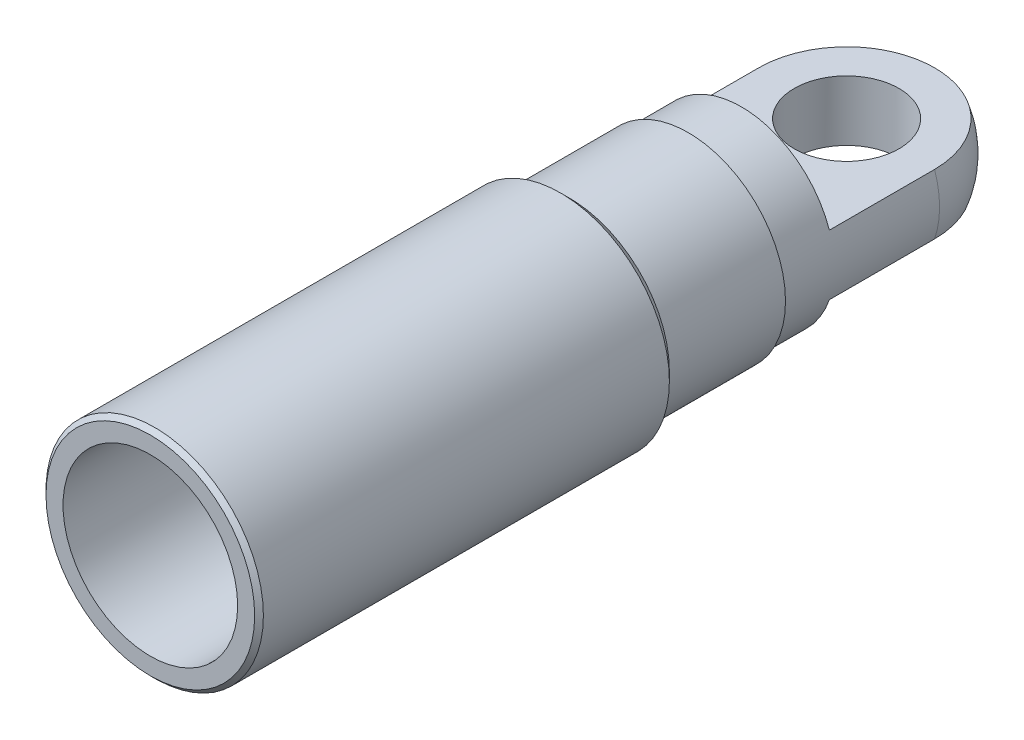
ISO-10303-21;
HEADER;
FILE_DESCRIPTION(('STEP AP214'),'2;1');
FILE_NAME('part.step','',(''),(''),'','','');
FILE_SCHEMA(('AUTOMOTIVE_DESIGN { 1 0 10303 214 1 1 1 1 }'));
ENDSEC;
DATA;
#1=APPLICATION_CONTEXT('core data for automotive mechanical design processes');
#2=APPLICATION_PROTOCOL_DEFINITION('international standard','automotive_design',2000,#1);
#3=PRODUCT_CONTEXT('',#1,'mechanical');
#4=PRODUCT('Part','Part','',(#3));
#5=PRODUCT_RELATED_PRODUCT_CATEGORY('part','',(#4));
#6=PRODUCT_DEFINITION_FORMATION('','',#4);
#7=PRODUCT_DEFINITION_CONTEXT('part definition',#1,'design');
#8=PRODUCT_DEFINITION('design','',#6,#7);
#9=PRODUCT_DEFINITION_SHAPE('','',#8);
#10=(LENGTH_UNIT() NAMED_UNIT(*) SI_UNIT(.MILLI.,.METRE.));
#11=(NAMED_UNIT(*) PLANE_ANGLE_UNIT() SI_UNIT($,.RADIAN.));
#12=(NAMED_UNIT(*) SI_UNIT($,.STERADIAN.) SOLID_ANGLE_UNIT());
#13=UNCERTAINTY_MEASURE_WITH_UNIT(LENGTH_MEASURE(1.E-05),#10,'distance_accuracy_value','');
#14=(GEOMETRIC_REPRESENTATION_CONTEXT(3) GLOBAL_UNCERTAINTY_ASSIGNED_CONTEXT((#13)) GLOBAL_UNIT_ASSIGNED_CONTEXT((#10,
#11,#12)) REPRESENTATION_CONTEXT('',''));
#15=CARTESIAN_POINT('',(0.,0.,0.));
#16=DIRECTION('',(0.,0.,1.));
#17=DIRECTION('',(1.,0.,0.));
#18=AXIS2_PLACEMENT_3D('',#15,#16,#17);
#19=CARTESIAN_POINT('',(0.,0.,14.4));
#20=DIRECTION('',(0.,0.,-1.));
#21=DIRECTION('',(-1.,0.,0.));
#22=AXIS2_PLACEMENT_3D('',#19,#20,#21);
#23=CYLINDRICAL_SURFACE('',#22,5.325);
#24=CARTESIAN_POINT('',(0.,0.,14.4));
#25=DIRECTION('',(0.,0.,1.));
#26=DIRECTION('',(1.,0.,0.));
#27=AXIS2_PLACEMENT_3D('',#24,#25,#26);
#28=CIRCLE('',#27,5.325);
#29=CARTESIAN_POINT('',(5.325,0.,14.4));
#30=VERTEX_POINT('',#29);
#31=EDGE_CURVE('E107',#30,#30,#28,.T.);
#32=ORIENTED_EDGE('',*,*,#31,.F.);
#33=EDGE_LOOP('',(#32));
#34=FACE_BOUND('',#33,.T.);
#35=DIRECTION('',(0.,0.,-1.));
#36=VECTOR('',#35,1.);
#37=CARTESIAN_POINT('',(-5.037856687124,-1.725,14.4));
#38=LINE('',#37,#36);
#39=CARTESIAN_POINT('',(-5.037856687124,-1.725,11.35));
#40=VERTEX_POINT('',#39);
#41=CARTESIAN_POINT('',(-5.037856687124,-1.725,5.325));
#42=VERTEX_POINT('',#41);
#43=EDGE_CURVE('E59',#40,#42,#38,.T.);
#44=ORIENTED_EDGE('',*,*,#43,.F.);
#45=CARTESIAN_POINT('',(0.,0.,11.35));
#46=DIRECTION('',(0.,0.,-1.));
#47=DIRECTION('',(-1.,0.,0.));
#48=AXIS2_PLACEMENT_3D('',#45,#46,#47);
#49=CIRCLE('',#48,5.325);
#50=CARTESIAN_POINT('',(5.037856687124,-1.725,11.35));
#51=VERTEX_POINT('',#50);
#52=EDGE_CURVE('E84',#51,#40,#49,.T.);
#53=ORIENTED_EDGE('',*,*,#52,.F.);
#54=DIRECTION('',(0.,0.,-1.));
#55=VECTOR('',#54,1.);
#56=CARTESIAN_POINT('',(5.037856687124,-1.725,14.4));
#57=LINE('',#56,#55);
#58=CARTESIAN_POINT('',(5.037856687124,-1.725,5.325));
#59=VERTEX_POINT('',#58);
#60=EDGE_CURVE('E96',#59,#51,#57,.F.);
#61=ORIENTED_EDGE('',*,*,#60,.F.);
#62=CARTESIAN_POINT('',(0.,0.,5.325));
#63=DIRECTION('',(0.,0.,-1.));
#64=DIRECTION('',(-1.,0.,0.));
#65=AXIS2_PLACEMENT_3D('',#62,#63,#64);
#66=CIRCLE('',#65,5.325);
#67=CARTESIAN_POINT('',(5.037856687124,1.725,5.325));
#68=VERTEX_POINT('',#67);
#69=EDGE_CURVE('E95',#59,#68,#66,.F.);
#70=ORIENTED_EDGE('',*,*,#69,.T.);
#71=DIRECTION('',(0.,0.,-1.));
#72=VECTOR('',#71,1.);
#73=CARTESIAN_POINT('',(5.037856687124,1.725,14.4));
#74=LINE('',#73,#72);
#75=CARTESIAN_POINT('',(5.037856687124,1.725,11.35));
#76=VERTEX_POINT('',#75);
#77=EDGE_CURVE('E51',#76,#68,#74,.T.);
#78=ORIENTED_EDGE('',*,*,#77,.F.);
#79=CARTESIAN_POINT('',(0.,0.,11.35));
#80=DIRECTION('',(0.,0.,-1.));
#81=DIRECTION('',(-1.,0.,0.));
#82=AXIS2_PLACEMENT_3D('',#79,#80,#81);
#83=CIRCLE('',#82,5.325);
#84=CARTESIAN_POINT('',(-5.037856687124,1.725,11.35));
#85=VERTEX_POINT('',#84);
#86=EDGE_CURVE('E79',#85,#76,#83,.T.);
#87=ORIENTED_EDGE('',*,*,#86,.F.);
#88=DIRECTION('',(0.,0.,-1.));
#89=VECTOR('',#88,1.);
#90=CARTESIAN_POINT('',(-5.037856687124,1.725,14.4));
#91=LINE('',#90,#89);
#92=CARTESIAN_POINT('',(-5.037856687124,1.725,5.325));
#93=VERTEX_POINT('',#92);
#94=EDGE_CURVE('E88',#93,#85,#91,.F.);
#95=ORIENTED_EDGE('',*,*,#94,.F.);
#96=EDGE_CURVE('E112',#93,#42,#66,.F.);
#97=ORIENTED_EDGE('',*,*,#96,.T.);
#98=EDGE_LOOP('',(#44,#53,#61,#70,#78,#87,#95,#97));
#99=FACE_BOUND('',#98,.T.);
#100=ADVANCED_FACE('F36',(#34,#99),#23,.T.);
#101=CARTESIAN_POINT('',(0.,0.,5.325));
#102=DIRECTION('',(0.,0.,1.));
#103=DIRECTION('',(1.,0.,0.));
#104=AXIS2_PLACEMENT_3D('',#101,#102,#103);
#105=SPHERICAL_SURFACE('',#104,5.325);
#106=ORIENTED_EDGE('',*,*,#69,.F.);
#107=CARTESIAN_POINT('',(0.,-1.725,5.325));
#108=DIRECTION('',(0.,-1.,0.));
#109=DIRECTION('',(0.,0.,-1.));
#110=AXIS2_PLACEMENT_3D('',#107,#108,#109);
#111=CIRCLE('',#110,5.037856687124);
#112=EDGE_CURVE('E85',#59,#42,#111,.F.);
#113=ORIENTED_EDGE('',*,*,#112,.T.);
#114=ORIENTED_EDGE('',*,*,#96,.F.);
#115=CARTESIAN_POINT('',(0.,1.725,5.325));
#116=DIRECTION('',(0.,1.,0.));
#117=DIRECTION('',(0.,0.,1.));
#118=AXIS2_PLACEMENT_3D('',#115,#116,#117);
#119=CIRCLE('',#118,5.037856687124);
#120=EDGE_CURVE('E115',#93,#68,#119,.F.);
#121=ORIENTED_EDGE('',*,*,#120,.T.);
#122=EDGE_LOOP('',(#106,#113,#114,#121));
#123=FACE_BOUND('',#122,.T.);
#124=ADVANCED_FACE('F144',(#123),#105,.T.);
#125=CARTESIAN_POINT('',(0.,0.,14.4));
#126=DIRECTION('',(0.,0.,1.));
#127=DIRECTION('',(1.,0.,0.));
#128=AXIS2_PLACEMENT_3D('',#125,#126,#127);
#129=PLANE('',#128);
#130=CARTESIAN_POINT('',(0.,0.,14.4));
#131=DIRECTION('',(0.,0.,1.));
#132=DIRECTION('',(1.,0.,0.));
#133=AXIS2_PLACEMENT_3D('',#130,#131,#132);
#134=CIRCLE('',#133,5.575);
#135=CARTESIAN_POINT('',(5.575,0.,14.4));
#136=VERTEX_POINT('',#135);
#137=EDGE_CURVE('E103',#136,#136,#134,.T.);
#138=ORIENTED_EDGE('',*,*,#137,.F.);
#139=EDGE_LOOP('',(#138));
#140=FACE_BOUND('',#139,.T.);
#141=ORIENTED_EDGE('',*,*,#31,.T.);
#142=EDGE_LOOP('',(#141));
#143=FACE_BOUND('',#142,.T.);
#144=ADVANCED_FACE('F150',(#140,#143),#129,.F.);
#145=CARTESIAN_POINT('',(0.,0.,21.2));
#146=DIRECTION('',(0.,0.,-1.));
#147=DIRECTION('',(-1.,0.,0.));
#148=AXIS2_PLACEMENT_3D('',#145,#146,#147);
#149=CYLINDRICAL_SURFACE('',#148,5.575);
#150=CARTESIAN_POINT('',(0.,0.,21.2));
#151=DIRECTION('',(0.,0.,1.));
#152=DIRECTION('',(1.,0.,0.));
#153=AXIS2_PLACEMENT_3D('',#150,#151,#152);
#154=CIRCLE('',#153,5.575);
#155=CARTESIAN_POINT('',(5.575,0.,21.2));
#156=VERTEX_POINT('',#155);
#157=EDGE_CURVE('E104',#156,#156,#154,.T.);
#158=ORIENTED_EDGE('',*,*,#157,.F.);
#159=EDGE_LOOP('',(#158));
#160=FACE_BOUND('',#159,.T.);
#161=ORIENTED_EDGE('',*,*,#137,.T.);
#162=EDGE_LOOP('',(#161));
#163=FACE_BOUND('',#162,.T.);
#164=ADVANCED_FACE('F155',(#160,#163),#149,.T.);
#165=CARTESIAN_POINT('',(0.,0.,21.2));
#166=DIRECTION('',(0.,0.,1.));
#167=DIRECTION('',(1.,0.,0.));
#168=AXIS2_PLACEMENT_3D('',#165,#166,#167);
#169=PLANE('',#168);
#170=CARTESIAN_POINT('',(0.,0.,21.2));
#171=DIRECTION('',(0.,0.,1.));
#172=DIRECTION('',(1.,0.,0.));
#173=AXIS2_PLACEMENT_3D('',#170,#171,#172);
#174=CIRCLE('',#173,5.725);
#175=CARTESIAN_POINT('',(5.725,0.,21.2));
#176=VERTEX_POINT('',#175);
#177=EDGE_CURVE('E125',#176,#176,#174,.F.);
#178=ORIENTED_EDGE('',*,*,#177,.T.);
#179=EDGE_LOOP('',(#178));
#180=FACE_BOUND('',#179,.T.);
#181=ORIENTED_EDGE('',*,*,#157,.T.);
#182=EDGE_LOOP('',(#181));
#183=FACE_BOUND('',#182,.T.);
#184=ADVANCED_FACE('F176',(#180,#183),#169,.F.);
#185=CARTESIAN_POINT('',(0.,0.,45.2));
#186=DIRECTION('',(0.,0.,-1.));
#187=DIRECTION('',(-1.,0.,0.));
#188=AXIS2_PLACEMENT_3D('',#185,#186,#187);
#189=CYLINDRICAL_SURFACE('',#188,6.225);
#190=CARTESIAN_POINT('',(0.,0.,44.95));
#191=DIRECTION('',(0.,0.,1.));
#192=DIRECTION('',(1.,0.,0.));
#193=AXIS2_PLACEMENT_3D('',#190,#191,#192);
#194=CIRCLE('',#193,6.225);
#195=CARTESIAN_POINT('',(6.225,0.,44.95));
#196=VERTEX_POINT('',#195);
#197=EDGE_CURVE('E11',#196,#196,#194,.F.);
#198=ORIENTED_EDGE('',*,*,#197,.T.);
#199=EDGE_LOOP('',(#198));
#200=FACE_BOUND('',#199,.T.);
#201=CARTESIAN_POINT('',(0.,0.,21.7));
#202=DIRECTION('',(0.,0.,1.));
#203=DIRECTION('',(1.,0.,0.));
#204=AXIS2_PLACEMENT_3D('',#201,#202,#203);
#205=CIRCLE('',#204,6.225);
#206=CARTESIAN_POINT('',(6.225,0.,21.7));
#207=VERTEX_POINT('',#206);
#208=EDGE_CURVE('E119',#207,#207,#205,.T.);
#209=ORIENTED_EDGE('',*,*,#208,.T.);
#210=EDGE_LOOP('',(#209));
#211=FACE_BOUND('',#210,.T.);
#212=ADVANCED_FACE('F174',(#200,#211),#189,.T.);
#213=CARTESIAN_POINT('',(0.,0.,45.2));
#214=DIRECTION('',(0.,0.,1.));
#215=DIRECTION('',(1.,0.,0.));
#216=AXIS2_PLACEMENT_3D('',#213,#214,#215);
#217=PLANE('',#216);
#218=CARTESIAN_POINT('',(0.,0.,45.2));
#219=DIRECTION('',(0.,0.,1.));
#220=DIRECTION('',(1.,0.,0.));
#221=AXIS2_PLACEMENT_3D('',#218,#219,#220);
#222=CIRCLE('',#221,5.97500000000001);
#223=CARTESIAN_POINT('',(5.97500000000001,0.,45.2));
#224=VERTEX_POINT('',#223);
#225=EDGE_CURVE('E44',#224,#224,#222,.T.);
#226=ORIENTED_EDGE('',*,*,#225,.T.);
#227=EDGE_LOOP('',(#226));
#228=FACE_BOUND('',#227,.T.);
#229=CARTESIAN_POINT('',(0.,0.,45.2));
#230=DIRECTION('',(0.,0.,1.));
#231=DIRECTION('',(1.,0.,0.));
#232=AXIS2_PLACEMENT_3D('',#229,#230,#231);
#233=CIRCLE('',#232,5.);
#234=CARTESIAN_POINT('',(5.,0.,45.2));
#235=VERTEX_POINT('',#234);
#236=EDGE_CURVE('E299',#235,#235,#233,.T.);
#237=ORIENTED_EDGE('',*,*,#236,.F.);
#238=EDGE_LOOP('',(#237));
#239=FACE_BOUND('',#238,.T.);
#240=ADVANCED_FACE('F130',(#228,#239),#217,.T.);
#241=CARTESIAN_POINT('',(48.,1.725,-2.22520442376383));
#242=DIRECTION('',(0.,1.,0.));
#243=DIRECTION('',(0.,0.,1.));
#244=AXIS2_PLACEMENT_3D('',#241,#242,#243);
#245=PLANE('',#244);
#246=CARTESIAN_POINT('',(0.,1.725,5.325));
#247=DIRECTION('',(0.,1.,0.));
#248=DIRECTION('',(0.,0.,1.));
#249=AXIS2_PLACEMENT_3D('',#246,#247,#248);
#250=CIRCLE('',#249,3.);
#251=CARTESIAN_POINT('',(0.,1.725,8.325));
#252=VERTEX_POINT('',#251);
#253=EDGE_CURVE('E122',#252,#252,#250,.T.);
#254=ORIENTED_EDGE('',*,*,#253,.F.);
#255=EDGE_LOOP('',(#254));
#256=FACE_BOUND('',#255,.T.);
#257=ORIENTED_EDGE('',*,*,#77,.T.);
#258=ORIENTED_EDGE('',*,*,#120,.F.);
#259=ORIENTED_EDGE('',*,*,#94,.T.);
#260=DIRECTION('',(-1.,0.,0.));
#261=VECTOR('',#260,1.);
#262=CARTESIAN_POINT('',(48.,1.725,11.35));
#263=LINE('',#262,#261);
#264=EDGE_CURVE('E81',#76,#85,#263,.T.);
#265=ORIENTED_EDGE('',*,*,#264,.F.);
#266=EDGE_LOOP('',(#257,#258,#259,#265));
#267=FACE_BOUND('',#266,.T.);
#268=ADVANCED_FACE('F87',(#256,#267),#245,.T.);
#269=CARTESIAN_POINT('',(48.,1.725,11.35));
#270=DIRECTION('',(0.,0.,-1.));
#271=DIRECTION('',(-1.,0.,0.));
#272=AXIS2_PLACEMENT_3D('',#269,#270,#271);
#273=PLANE('',#272);
#274=ORIENTED_EDGE('',*,*,#86,.T.);
#275=ORIENTED_EDGE('',*,*,#264,.T.);
#276=EDGE_LOOP('',(#274,#275));
#277=FACE_BOUND('',#276,.T.);
#278=ADVANCED_FACE('F80',(#277),#273,.T.);
#279=CARTESIAN_POINT('',(48.,-14.3177223884598,11.35));
#280=DIRECTION('',(0.,0.,-1.));
#281=DIRECTION('',(-1.,0.,0.));
#282=AXIS2_PLACEMENT_3D('',#279,#280,#281);
#283=PLANE('',#282);
#284=ORIENTED_EDGE('',*,*,#52,.T.);
#285=DIRECTION('',(-1.,0.,0.));
#286=VECTOR('',#285,1.);
#287=CARTESIAN_POINT('',(48.,-1.725,11.35));
#288=LINE('',#287,#286);
#289=EDGE_CURVE('E89',#51,#40,#288,.T.);
#290=ORIENTED_EDGE('',*,*,#289,.F.);
#291=EDGE_LOOP('',(#284,#290));
#292=FACE_BOUND('',#291,.T.);
#293=ADVANCED_FACE('F254',(#292),#283,.T.);
#294=CARTESIAN_POINT('',(48.,-1.725,-2.22520442376383));
#295=DIRECTION('',(0.,-1.,0.));
#296=DIRECTION('',(0.,0.,-1.));
#297=AXIS2_PLACEMENT_3D('',#294,#295,#296);
#298=PLANE('',#297);
#299=CARTESIAN_POINT('',(0.,-1.725,5.325));
#300=DIRECTION('',(0.,-1.,0.));
#301=DIRECTION('',(0.,0.,-1.));
#302=AXIS2_PLACEMENT_3D('',#299,#300,#301);
#303=CIRCLE('',#302,3.);
#304=CARTESIAN_POINT('',(0.,-1.725,2.325));
#305=VERTEX_POINT('',#304);
#306=EDGE_CURVE('E90',#305,#305,#303,.T.);
#307=ORIENTED_EDGE('',*,*,#306,.F.);
#308=EDGE_LOOP('',(#307));
#309=FACE_BOUND('',#308,.T.);
#310=ORIENTED_EDGE('',*,*,#43,.T.);
#311=ORIENTED_EDGE('',*,*,#112,.F.);
#312=ORIENTED_EDGE('',*,*,#60,.T.);
#313=ORIENTED_EDGE('',*,*,#289,.T.);
#314=EDGE_LOOP('',(#310,#311,#312,#313));
#315=FACE_BOUND('',#314,.T.);
#316=ADVANCED_FACE('F167',(#309,#315),#298,.T.);
#317=CARTESIAN_POINT('',(0.,-46.275,5.32499999999999));
#318=DIRECTION('',(0.,1.,0.));
#319=DIRECTION('',(0.,0.,1.));
#320=AXIS2_PLACEMENT_3D('',#317,#318,#319);
#321=CYLINDRICAL_SURFACE('',#320,3.);
#322=ORIENTED_EDGE('',*,*,#306,.T.);
#323=EDGE_LOOP('',(#322));
#324=FACE_BOUND('',#323,.T.);
#325=ORIENTED_EDGE('',*,*,#253,.T.);
#326=EDGE_LOOP('',(#325));
#327=FACE_BOUND('',#326,.T.);
#328=ADVANCED_FACE('F159',(#324,#327),#321,.F.);
#329=CARTESIAN_POINT('',(0.,0.,21.7));
#330=DIRECTION('',(0.,0.,1.));
#331=DIRECTION('',(1.,0.,0.));
#332=AXIS2_PLACEMENT_3D('',#329,#330,#331);
#333=CONICAL_SURFACE('',#332,6.225,0.785398163397453);
#334=ORIENTED_EDGE('',*,*,#177,.F.);
#335=EDGE_LOOP('',(#334));
#336=FACE_BOUND('',#335,.T.);
#337=ORIENTED_EDGE('',*,*,#208,.F.);
#338=EDGE_LOOP('',(#337));
#339=FACE_BOUND('',#338,.T.);
#340=ADVANCED_FACE('F157',(#336,#339),#333,.T.);
#341=CARTESIAN_POINT('',(0.,0.,12.7));
#342=DIRECTION('',(0.,0.,1.));
#343=DIRECTION('',(1.,0.,0.));
#344=AXIS2_PLACEMENT_3D('',#341,#342,#343);
#345=CYLINDRICAL_SURFACE('',#344,5.);
#346=CARTESIAN_POINT('',(0.,0.,12.7));
#347=DIRECTION('',(0.,0.,1.));
#348=DIRECTION('',(1.,0.,0.));
#349=AXIS2_PLACEMENT_3D('',#346,#347,#348);
#350=CIRCLE('',#349,5.);
#351=CARTESIAN_POINT('',(5.,0.,12.7));
#352=VERTEX_POINT('',#351);
#353=EDGE_CURVE('E296',#352,#352,#350,.T.);
#354=ORIENTED_EDGE('',*,*,#353,.F.);
#355=EDGE_LOOP('',(#354));
#356=FACE_BOUND('',#355,.T.);
#357=ORIENTED_EDGE('',*,*,#236,.T.);
#358=EDGE_LOOP('',(#357));
#359=FACE_BOUND('',#358,.T.);
#360=ADVANCED_FACE('F139',(#356,#359),#345,.F.);
#361=CARTESIAN_POINT('',(0.,0.,12.7));
#362=DIRECTION('',(0.,0.,1.));
#363=DIRECTION('',(1.,0.,0.));
#364=AXIS2_PLACEMENT_3D('',#361,#362,#363);
#365=PLANE('',#364);
#366=ORIENTED_EDGE('',*,*,#353,.T.);
#367=EDGE_LOOP('',(#366));
#368=FACE_BOUND('',#367,.T.);
#369=ADVANCED_FACE('F134',(#368),#365,.T.);
#370=CARTESIAN_POINT('',(0.,0.,45.2));
#371=DIRECTION('',(0.,0.,-1.));
#372=DIRECTION('',(-1.,0.,0.));
#373=AXIS2_PLACEMENT_3D('',#370,#371,#372);
#374=CONICAL_SURFACE('',#373,5.97500000000001,0.785398163397443);
#375=ORIENTED_EDGE('',*,*,#197,.F.);
#376=EDGE_LOOP('',(#375));
#377=FACE_BOUND('',#376,.T.);
#378=ORIENTED_EDGE('',*,*,#225,.F.);
#379=EDGE_LOOP('',(#378));
#380=FACE_BOUND('',#379,.T.);
#381=ADVANCED_FACE('F38',(#377,#380),#374,.T.);
#382=CLOSED_SHELL('',(#100,#124,#144,#164,#184,#212,#240,#268,#278,#293,#316,#328,#340,#360,
#369,#381));
#383=MANIFOLD_SOLID_BREP('B2',#382);
#384=ADVANCED_BREP_SHAPE_REPRESENTATION('',(#18,#383),#14);
#385=SHAPE_DEFINITION_REPRESENTATION(#9,#384);
ENDSEC;
END-ISO-10303-21;
